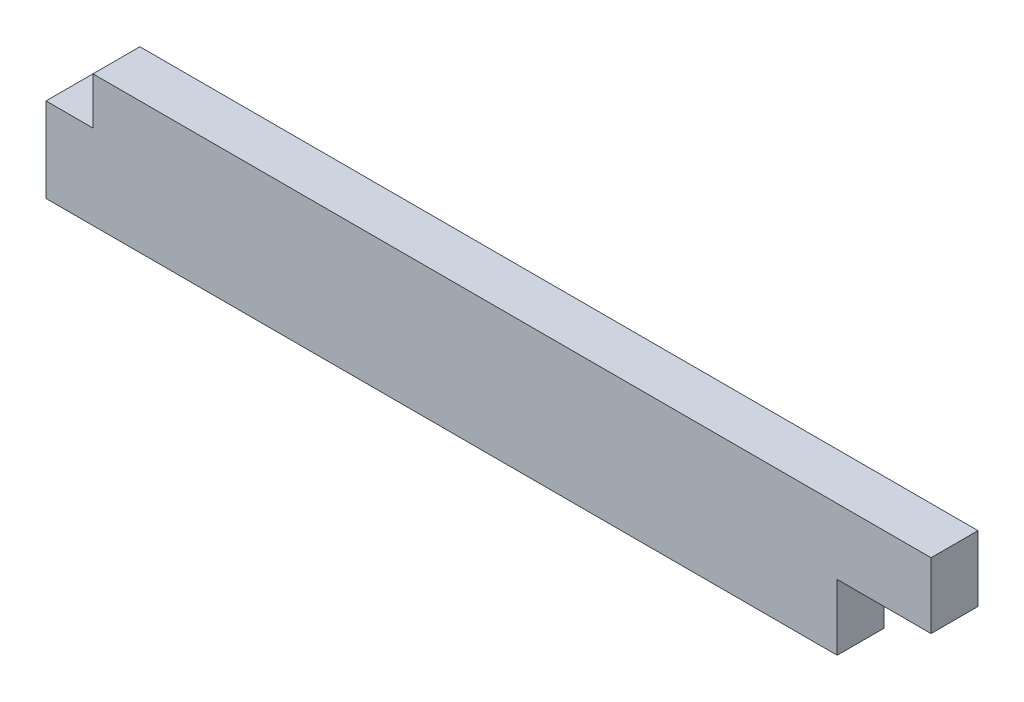
ISO-10303-21;
HEADER;
FILE_DESCRIPTION(('STEP AP214'),'2;1');
FILE_NAME('part.step','',(''),(''),'','','');
FILE_SCHEMA(('AUTOMOTIVE_DESIGN { 1 0 10303 214 1 1 1 1 }'));
ENDSEC;
DATA;
#1=APPLICATION_CONTEXT('core data for automotive mechanical design processes');
#2=APPLICATION_PROTOCOL_DEFINITION('international standard','automotive_design',2000,#1);
#3=PRODUCT_CONTEXT('',#1,'mechanical');
#4=PRODUCT('Part','Part','',(#3));
#5=PRODUCT_RELATED_PRODUCT_CATEGORY('part','',(#4));
#6=PRODUCT_DEFINITION_FORMATION('','',#4);
#7=PRODUCT_DEFINITION_CONTEXT('part definition',#1,'design');
#8=PRODUCT_DEFINITION('design','',#6,#7);
#9=PRODUCT_DEFINITION_SHAPE('','',#8);
#10=(LENGTH_UNIT() NAMED_UNIT(*) SI_UNIT(.MILLI.,.METRE.));
#11=(NAMED_UNIT(*) PLANE_ANGLE_UNIT() SI_UNIT($,.RADIAN.));
#12=(NAMED_UNIT(*) SI_UNIT($,.STERADIAN.) SOLID_ANGLE_UNIT());
#13=UNCERTAINTY_MEASURE_WITH_UNIT(LENGTH_MEASURE(1.E-05),#10,'distance_accuracy_value','');
#14=(GEOMETRIC_REPRESENTATION_CONTEXT(3) GLOBAL_UNCERTAINTY_ASSIGNED_CONTEXT((#13)) GLOBAL_UNIT_ASSIGNED_CONTEXT((#10,
#11,#12)) REPRESENTATION_CONTEXT('',''));
#15=CARTESIAN_POINT('',(0.,0.,0.));
#16=DIRECTION('',(0.,0.,1.));
#17=DIRECTION('',(1.,0.,0.));
#18=AXIS2_PLACEMENT_3D('',#15,#16,#17);
#19=CARTESIAN_POINT('',(18.8571428571429,1.12,1.4));
#20=DIRECTION('',(-1.,0.,0.));
#21=DIRECTION('',(0.,0.,1.));
#22=AXIS2_PLACEMENT_3D('',#19,#20,#21);
#23=PLANE('',#22);
#24=DIRECTION('',(0.,1.,0.));
#25=VECTOR('',#24,1.);
#26=CARTESIAN_POINT('',(18.8571428571429,1.12,-1.4));
#27=LINE('',#26,#25);
#28=CARTESIAN_POINT('',(18.8571428571429,1.12,-1.4));
#29=VERTEX_POINT('',#28);
#30=CARTESIAN_POINT('',(18.8571428571429,5.04,-1.4));
#31=VERTEX_POINT('',#30);
#32=EDGE_CURVE('E128',#29,#31,#27,.T.);
#33=ORIENTED_EDGE('',*,*,#32,.T.);
#34=DIRECTION('',(0.,0.,-1.));
#35=VECTOR('',#34,1.);
#36=CARTESIAN_POINT('',(18.8571428571429,5.04,1.4));
#37=LINE('',#36,#35);
#38=CARTESIAN_POINT('',(18.8571428571429,5.04,1.4));
#39=VERTEX_POINT('',#38);
#40=EDGE_CURVE('E11',#39,#31,#37,.T.);
#41=ORIENTED_EDGE('',*,*,#40,.F.);
#42=DIRECTION('',(0.,1.,0.));
#43=VECTOR('',#42,1.);
#44=CARTESIAN_POINT('',(18.8571428571429,1.12,1.4));
#45=LINE('',#44,#43);
#46=CARTESIAN_POINT('',(18.8571428571429,1.12,1.4));
#47=VERTEX_POINT('',#46);
#48=EDGE_CURVE('E144',#47,#39,#45,.T.);
#49=ORIENTED_EDGE('',*,*,#48,.F.);
#50=DIRECTION('',(0.,0.,-1.));
#51=VECTOR('',#50,1.);
#52=CARTESIAN_POINT('',(18.8571428571429,1.12,1.4));
#53=LINE('',#52,#51);
#54=EDGE_CURVE('E124',#47,#29,#53,.T.);
#55=ORIENTED_EDGE('',*,*,#54,.T.);
#56=EDGE_LOOP('',(#33,#41,#49,#55));
#57=FACE_BOUND('',#56,.T.);
#58=ADVANCED_FACE('F33',(#57),#23,.F.);
#59=CARTESIAN_POINT('',(-31.1428571428571,5.04,1.4));
#60=DIRECTION('',(0.,-1.,0.));
#61=DIRECTION('',(0.,0.,-1.));
#62=AXIS2_PLACEMENT_3D('',#59,#60,#61);
#63=PLANE('',#62);
#64=DIRECTION('',(-1.,0.,0.));
#65=VECTOR('',#64,1.);
#66=CARTESIAN_POINT('',(-31.1428571428571,5.04,-1.4));
#67=LINE('',#66,#65);
#68=CARTESIAN_POINT('',(-31.1428571428571,5.04,-1.4));
#69=VERTEX_POINT('',#68);
#70=EDGE_CURVE('E131',#31,#69,#67,.T.);
#71=ORIENTED_EDGE('',*,*,#70,.T.);
#72=DIRECTION('',(0.,0.,-1.));
#73=VECTOR('',#72,1.);
#74=CARTESIAN_POINT('',(-31.1428571428571,5.04,1.4));
#75=LINE('',#74,#73);
#76=CARTESIAN_POINT('',(-31.1428571428571,5.04,1.4));
#77=VERTEX_POINT('',#76);
#78=EDGE_CURVE('E41',#77,#69,#75,.T.);
#79=ORIENTED_EDGE('',*,*,#78,.F.);
#80=DIRECTION('',(-1.,0.,0.));
#81=VECTOR('',#80,1.);
#82=CARTESIAN_POINT('',(-31.1428571428571,5.04,1.4));
#83=LINE('',#82,#81);
#84=EDGE_CURVE('E92',#39,#77,#83,.T.);
#85=ORIENTED_EDGE('',*,*,#84,.F.);
#86=ORIENTED_EDGE('',*,*,#40,.T.);
#87=EDGE_LOOP('',(#71,#79,#85,#86));
#88=FACE_BOUND('',#87,.T.);
#89=ADVANCED_FACE('F178',(#88),#63,.F.);
#90=CARTESIAN_POINT('',(-31.1428571428571,2.24,1.4));
#91=DIRECTION('',(1.,0.,0.));
#92=DIRECTION('',(0.,0.,-1.));
#93=AXIS2_PLACEMENT_3D('',#90,#91,#92);
#94=PLANE('',#93);
#95=DIRECTION('',(0.,-1.,0.));
#96=VECTOR('',#95,1.);
#97=CARTESIAN_POINT('',(-31.1428571428571,2.24,-1.4));
#98=LINE('',#97,#96);
#99=CARTESIAN_POINT('',(-31.1428571428571,2.24,-1.4));
#100=VERTEX_POINT('',#99);
#101=EDGE_CURVE('E133',#69,#100,#98,.T.);
#102=ORIENTED_EDGE('',*,*,#101,.T.);
#103=DIRECTION('',(0.,0.,-1.));
#104=VECTOR('',#103,1.);
#105=CARTESIAN_POINT('',(-31.1428571428571,2.24,1.4));
#106=LINE('',#105,#104);
#107=CARTESIAN_POINT('',(-31.1428571428571,2.24,1.4));
#108=VERTEX_POINT('',#107);
#109=EDGE_CURVE('E151',#108,#100,#106,.T.);
#110=ORIENTED_EDGE('',*,*,#109,.F.);
#111=DIRECTION('',(0.,-1.,0.));
#112=VECTOR('',#111,1.);
#113=CARTESIAN_POINT('',(-31.1428571428571,2.24,1.4));
#114=LINE('',#113,#112);
#115=EDGE_CURVE('E159',#77,#108,#114,.T.);
#116=ORIENTED_EDGE('',*,*,#115,.F.);
#117=ORIENTED_EDGE('',*,*,#78,.T.);
#118=EDGE_LOOP('',(#102,#110,#116,#117));
#119=FACE_BOUND('',#118,.T.);
#120=ADVANCED_FACE('F157',(#119),#94,.F.);
#121=CARTESIAN_POINT('',(-33.9428571428571,2.24,1.4));
#122=DIRECTION('',(0.,-1.,0.));
#123=DIRECTION('',(0.,0.,-1.));
#124=AXIS2_PLACEMENT_3D('',#121,#122,#123);
#125=PLANE('',#124);
#126=DIRECTION('',(-1.,0.,0.));
#127=VECTOR('',#126,1.);
#128=CARTESIAN_POINT('',(-33.9428571428571,2.24,-1.4));
#129=LINE('',#128,#127);
#130=CARTESIAN_POINT('',(-33.9428571428571,2.24,-1.4));
#131=VERTEX_POINT('',#130);
#132=EDGE_CURVE('E135',#100,#131,#129,.T.);
#133=ORIENTED_EDGE('',*,*,#132,.T.);
#134=DIRECTION('',(0.,0.,-1.));
#135=VECTOR('',#134,1.);
#136=CARTESIAN_POINT('',(-33.9428571428571,2.24,1.4));
#137=LINE('',#136,#135);
#138=CARTESIAN_POINT('',(-33.9428571428571,2.24,1.4));
#139=VERTEX_POINT('',#138);
#140=EDGE_CURVE('E148',#139,#131,#137,.T.);
#141=ORIENTED_EDGE('',*,*,#140,.F.);
#142=DIRECTION('',(-1.,0.,0.));
#143=VECTOR('',#142,1.);
#144=CARTESIAN_POINT('',(-33.9428571428571,2.24,1.4));
#145=LINE('',#144,#143);
#146=EDGE_CURVE('E170',#108,#139,#145,.T.);
#147=ORIENTED_EDGE('',*,*,#146,.F.);
#148=ORIENTED_EDGE('',*,*,#109,.T.);
#149=EDGE_LOOP('',(#133,#141,#147,#148));
#150=FACE_BOUND('',#149,.T.);
#151=ADVANCED_FACE('F166',(#150),#125,.F.);
#152=CARTESIAN_POINT('',(-33.9428571428571,0.,1.4));
#153=DIRECTION('',(1.,0.,0.));
#154=DIRECTION('',(0.,0.,-1.));
#155=AXIS2_PLACEMENT_3D('',#152,#153,#154);
#156=PLANE('',#155);
#157=DIRECTION('',(0.,-1.,0.));
#158=VECTOR('',#157,1.);
#159=CARTESIAN_POINT('',(-33.9428571428571,0.,-1.4));
#160=LINE('',#159,#158);
#161=CARTESIAN_POINT('',(-33.9428571428571,-2.8,-1.4));
#162=VERTEX_POINT('',#161);
#163=EDGE_CURVE('E138',#131,#162,#160,.T.);
#164=ORIENTED_EDGE('',*,*,#163,.T.);
#165=DIRECTION('',(0.,0.,-1.));
#166=VECTOR('',#165,1.);
#167=CARTESIAN_POINT('',(-33.9428571428571,-2.8,1.4));
#168=LINE('',#167,#166);
#169=CARTESIAN_POINT('',(-33.9428571428571,-2.8,1.4));
#170=VERTEX_POINT('',#169);
#171=EDGE_CURVE('E119',#170,#162,#168,.T.);
#172=ORIENTED_EDGE('',*,*,#171,.F.);
#173=DIRECTION('',(0.,-1.,0.));
#174=VECTOR('',#173,1.);
#175=CARTESIAN_POINT('',(-33.9428571428571,0.,1.4));
#176=LINE('',#175,#174);
#177=EDGE_CURVE('E111',#139,#170,#176,.T.);
#178=ORIENTED_EDGE('',*,*,#177,.F.);
#179=ORIENTED_EDGE('',*,*,#140,.T.);
#180=EDGE_LOOP('',(#164,#172,#178,#179));
#181=FACE_BOUND('',#180,.T.);
#182=ADVANCED_FACE('F169',(#181),#156,.F.);
#183=CARTESIAN_POINT('',(-31.1428571428571,-2.8,1.4));
#184=DIRECTION('',(0.,1.,0.));
#185=DIRECTION('',(0.,0.,1.));
#186=AXIS2_PLACEMENT_3D('',#183,#184,#185);
#187=PLANE('',#186);
#188=DIRECTION('',(1.,0.,0.));
#189=VECTOR('',#188,1.);
#190=CARTESIAN_POINT('',(-31.1428571428571,-2.8,-1.4));
#191=LINE('',#190,#189);
#192=CARTESIAN_POINT('',(13.2571428571429,-2.8,-1.4));
#193=VERTEX_POINT('',#192);
#194=EDGE_CURVE('E118',#162,#193,#191,.T.);
#195=ORIENTED_EDGE('',*,*,#194,.T.);
#196=DIRECTION('',(0.,0.,-1.));
#197=VECTOR('',#196,1.);
#198=CARTESIAN_POINT('',(13.2571428571429,-2.8,1.4));
#199=LINE('',#198,#197);
#200=CARTESIAN_POINT('',(13.2571428571429,-2.8,1.4));
#201=VERTEX_POINT('',#200);
#202=EDGE_CURVE('E116',#201,#193,#199,.T.);
#203=ORIENTED_EDGE('',*,*,#202,.F.);
#204=DIRECTION('',(1.,0.,0.));
#205=VECTOR('',#204,1.);
#206=CARTESIAN_POINT('',(-33.9428571428571,-2.8,1.4));
#207=LINE('',#206,#205);
#208=EDGE_CURVE('E105',#170,#201,#207,.T.);
#209=ORIENTED_EDGE('',*,*,#208,.F.);
#210=ORIENTED_EDGE('',*,*,#171,.T.);
#211=EDGE_LOOP('',(#195,#203,#209,#210));
#212=FACE_BOUND('',#211,.T.);
#213=ADVANCED_FACE('F117',(#212),#187,.F.);
#214=CARTESIAN_POINT('',(13.2571428571429,1.12,1.4));
#215=DIRECTION('',(-1.,0.,0.));
#216=DIRECTION('',(0.,0.,1.));
#217=AXIS2_PLACEMENT_3D('',#214,#215,#216);
#218=PLANE('',#217);
#219=DIRECTION('',(0.,1.,0.));
#220=VECTOR('',#219,1.);
#221=CARTESIAN_POINT('',(13.2571428571429,1.12,-1.4));
#222=LINE('',#221,#220);
#223=CARTESIAN_POINT('',(13.2571428571429,1.12,-1.4));
#224=VERTEX_POINT('',#223);
#225=EDGE_CURVE('E78',#193,#224,#222,.T.);
#226=ORIENTED_EDGE('',*,*,#225,.T.);
#227=DIRECTION('',(0.,0.,-1.));
#228=VECTOR('',#227,1.);
#229=CARTESIAN_POINT('',(13.2571428571429,1.12,1.4));
#230=LINE('',#229,#228);
#231=CARTESIAN_POINT('',(13.2571428571429,1.12,1.4));
#232=VERTEX_POINT('',#231);
#233=EDGE_CURVE('E120',#232,#224,#230,.T.);
#234=ORIENTED_EDGE('',*,*,#233,.F.);
#235=DIRECTION('',(0.,1.,0.));
#236=VECTOR('',#235,1.);
#237=CARTESIAN_POINT('',(13.2571428571429,1.12,1.4));
#238=LINE('',#237,#236);
#239=EDGE_CURVE('E109',#201,#232,#238,.T.);
#240=ORIENTED_EDGE('',*,*,#239,.F.);
#241=ORIENTED_EDGE('',*,*,#202,.T.);
#242=EDGE_LOOP('',(#226,#234,#240,#241));
#243=FACE_BOUND('',#242,.T.);
#244=ADVANCED_FACE('F122',(#243),#218,.F.);
#245=CARTESIAN_POINT('',(18.8571428571429,1.12,1.4));
#246=DIRECTION('',(0.,1.,0.));
#247=DIRECTION('',(-1.,0.,0.));
#248=AXIS2_PLACEMENT_3D('',#245,#246,#247);
#249=PLANE('',#248);
#250=DIRECTION('',(1.,0.,0.));
#251=VECTOR('',#250,1.);
#252=CARTESIAN_POINT('',(18.8571428571429,1.12,-1.4));
#253=LINE('',#252,#251);
#254=EDGE_CURVE('E84',#224,#29,#253,.T.);
#255=ORIENTED_EDGE('',*,*,#254,.T.);
#256=ORIENTED_EDGE('',*,*,#54,.F.);
#257=DIRECTION('',(1.,0.,0.));
#258=VECTOR('',#257,1.);
#259=CARTESIAN_POINT('',(18.8571428571429,1.12,1.4));
#260=LINE('',#259,#258);
#261=EDGE_CURVE('E49',#232,#47,#260,.T.);
#262=ORIENTED_EDGE('',*,*,#261,.F.);
#263=ORIENTED_EDGE('',*,*,#233,.T.);
#264=EDGE_LOOP('',(#255,#256,#262,#263));
#265=FACE_BOUND('',#264,.T.);
#266=ADVANCED_FACE('F194',(#265),#249,.F.);
#267=CARTESIAN_POINT('',(0.,0.,1.4));
#268=DIRECTION('',(0.,0.,-1.));
#269=DIRECTION('',(-1.,0.,0.));
#270=AXIS2_PLACEMENT_3D('',#267,#268,#269);
#271=PLANE('',#270);
#272=ORIENTED_EDGE('',*,*,#48,.T.);
#273=ORIENTED_EDGE('',*,*,#84,.T.);
#274=ORIENTED_EDGE('',*,*,#115,.T.);
#275=ORIENTED_EDGE('',*,*,#146,.T.);
#276=ORIENTED_EDGE('',*,*,#177,.T.);
#277=ORIENTED_EDGE('',*,*,#208,.T.);
#278=ORIENTED_EDGE('',*,*,#239,.T.);
#279=ORIENTED_EDGE('',*,*,#261,.T.);
#280=EDGE_LOOP('',(#272,#273,#274,#275,#276,#277,#278,#279));
#281=FACE_BOUND('',#280,.T.);
#282=ADVANCED_FACE('F107',(#281),#271,.F.);
#283=CARTESIAN_POINT('',(0.,0.,-1.4));
#284=DIRECTION('',(0.,0.,-1.));
#285=DIRECTION('',(-1.,0.,0.));
#286=AXIS2_PLACEMENT_3D('',#283,#284,#285);
#287=PLANE('',#286);
#288=ORIENTED_EDGE('',*,*,#32,.F.);
#289=ORIENTED_EDGE('',*,*,#254,.F.);
#290=ORIENTED_EDGE('',*,*,#225,.F.);
#291=ORIENTED_EDGE('',*,*,#194,.F.);
#292=ORIENTED_EDGE('',*,*,#163,.F.);
#293=ORIENTED_EDGE('',*,*,#132,.F.);
#294=ORIENTED_EDGE('',*,*,#101,.F.);
#295=ORIENTED_EDGE('',*,*,#70,.F.);
#296=EDGE_LOOP('',(#288,#289,#290,#291,#292,#293,#294,#295));
#297=FACE_BOUND('',#296,.T.);
#298=ADVANCED_FACE('F163',(#297),#287,.T.);
#299=CLOSED_SHELL('',(#58,#89,#120,#151,#182,#213,#244,#266,#282,#298));
#300=MANIFOLD_SOLID_BREP('B2',#299);
#301=ADVANCED_BREP_SHAPE_REPRESENTATION('',(#18,#300),#14);
#302=SHAPE_DEFINITION_REPRESENTATION(#9,#301);
ENDSEC;
END-ISO-10303-21;
